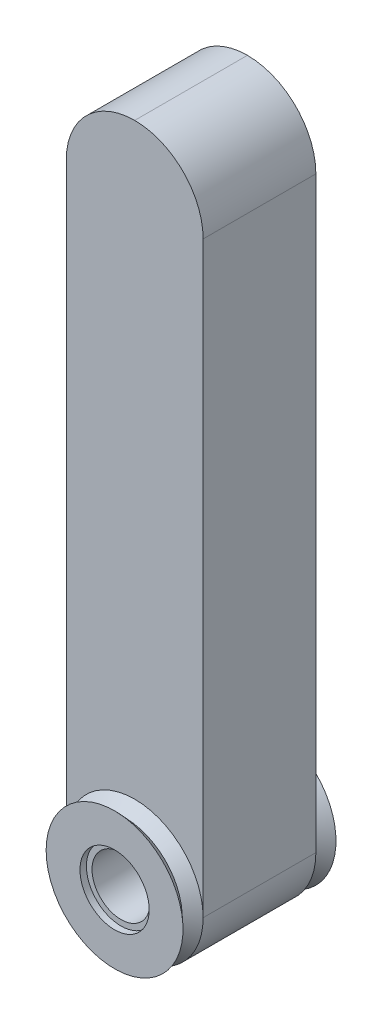
ISO-10303-21;
HEADER;
FILE_DESCRIPTION(('STEP AP214'),'2;1');
FILE_NAME('part.step','',(''),(''),'','','');
FILE_SCHEMA(('AUTOMOTIVE_DESIGN { 1 0 10303 214 1 1 1 1 }'));
ENDSEC;
DATA;
#1=APPLICATION_CONTEXT('core data for automotive mechanical design processes');
#2=APPLICATION_PROTOCOL_DEFINITION('international standard','automotive_design',2000,#1);
#3=PRODUCT_CONTEXT('',#1,'mechanical');
#4=PRODUCT('Part','Part','',(#3));
#5=PRODUCT_RELATED_PRODUCT_CATEGORY('part','',(#4));
#6=PRODUCT_DEFINITION_FORMATION('','',#4);
#7=PRODUCT_DEFINITION_CONTEXT('part definition',#1,'design');
#8=PRODUCT_DEFINITION('design','',#6,#7);
#9=PRODUCT_DEFINITION_SHAPE('','',#8);
#10=(LENGTH_UNIT() NAMED_UNIT(*) SI_UNIT(.MILLI.,.METRE.));
#11=(NAMED_UNIT(*) PLANE_ANGLE_UNIT() SI_UNIT($,.RADIAN.));
#12=(NAMED_UNIT(*) SI_UNIT($,.STERADIAN.) SOLID_ANGLE_UNIT());
#13=UNCERTAINTY_MEASURE_WITH_UNIT(LENGTH_MEASURE(1.E-05),#10,'distance_accuracy_value','');
#14=(GEOMETRIC_REPRESENTATION_CONTEXT(3) GLOBAL_UNCERTAINTY_ASSIGNED_CONTEXT((#13)) GLOBAL_UNIT_ASSIGNED_CONTEXT((#10,
#11,#12)) REPRESENTATION_CONTEXT('',''));
#15=CARTESIAN_POINT('',(0.,0.,0.));
#16=DIRECTION('',(0.,0.,1.));
#17=DIRECTION('',(1.,0.,0.));
#18=AXIS2_PLACEMENT_3D('',#15,#16,#17);
#19=CARTESIAN_POINT('',(0.,-36.5,7.));
#20=DIRECTION('',(0.,0.,-1.));
#21=DIRECTION('',(-1.,0.,0.));
#22=AXIS2_PLACEMENT_3D('',#19,#20,#21);
#23=CYLINDRICAL_SURFACE('',#22,3.6);
#24=CARTESIAN_POINT('',(0.,-36.5,8.7));
#25=DIRECTION('',(0.,0.,1.));
#26=DIRECTION('',(1.,0.,0.));
#27=AXIS2_PLACEMENT_3D('',#24,#25,#26);
#28=CIRCLE('',#27,3.6);
#29=CARTESIAN_POINT('',(3.6,-36.5,8.7));
#30=VERTEX_POINT('',#29);
#31=EDGE_CURVE('E144',#30,#30,#28,.T.);
#32=ORIENTED_EDGE('',*,*,#31,.T.);
#33=EDGE_LOOP('',(#32));
#34=FACE_BOUND('',#33,.T.);
#35=CARTESIAN_POINT('',(0.,-36.5,-8.7));
#36=DIRECTION('',(0.,0.,-1.));
#37=DIRECTION('',(-1.,0.,0.));
#38=AXIS2_PLACEMENT_3D('',#35,#36,#37);
#39=CIRCLE('',#38,3.6);
#40=CARTESIAN_POINT('',(-3.6,-36.5,-8.7));
#41=VERTEX_POINT('',#40);
#42=EDGE_CURVE('E36',#41,#41,#39,.T.);
#43=ORIENTED_EDGE('',*,*,#42,.T.);
#44=EDGE_LOOP('',(#43));
#45=FACE_BOUND('',#44,.T.);
#46=ADVANCED_FACE('F32',(#34,#45),#23,.F.);
#47=CARTESIAN_POINT('',(0.,-36.5,7.));
#48=DIRECTION('',(0.,0.,-1.));
#49=DIRECTION('',(-1.,0.,0.));
#50=AXIS2_PLACEMENT_3D('',#47,#48,#49);
#51=CYLINDRICAL_SURFACE('',#50,8.5);
#52=CARTESIAN_POINT('',(0.,-36.5,-7.));
#53=DIRECTION('',(0.,0.,-1.));
#54=DIRECTION('',(-1.,0.,0.));
#55=AXIS2_PLACEMENT_3D('',#52,#53,#54);
#56=CIRCLE('',#55,8.50000000000001);
#57=CARTESIAN_POINT('',(8.50000000000001,-36.5,-7.));
#58=VERTEX_POINT('',#57);
#59=CARTESIAN_POINT('',(0.,-45.,-7.));
#60=VERTEX_POINT('',#59);
#61=EDGE_CURVE('E91',#58,#60,#56,.T.);
#62=ORIENTED_EDGE('',*,*,#61,.F.);
#63=DIRECTION('',(0.,0.,-1.));
#64=VECTOR('',#63,1.);
#65=CARTESIAN_POINT('',(8.5,-36.5,7.));
#66=LINE('',#65,#64);
#67=CARTESIAN_POINT('',(8.5,-36.5,7.));
#68=VERTEX_POINT('',#67);
#69=EDGE_CURVE('E107',#68,#58,#66,.T.);
#70=ORIENTED_EDGE('',*,*,#69,.F.);
#71=CARTESIAN_POINT('',(0.,-36.5,7.));
#72=DIRECTION('',(0.,0.,-1.));
#73=DIRECTION('',(-1.,0.,0.));
#74=AXIS2_PLACEMENT_3D('',#71,#72,#73);
#75=CIRCLE('',#74,8.50000000000001);
#76=CARTESIAN_POINT('',(0.,-45.,7.));
#77=VERTEX_POINT('',#76);
#78=EDGE_CURVE('E151',#68,#77,#75,.T.);
#79=ORIENTED_EDGE('',*,*,#78,.T.);
#80=DIRECTION('',(0.,0.,-1.));
#81=VECTOR('',#80,1.);
#82=CARTESIAN_POINT('',(0.,-45.,7.));
#83=LINE('',#82,#81);
#84=EDGE_CURVE('E110',#77,#60,#83,.T.);
#85=ORIENTED_EDGE('',*,*,#84,.T.);
#86=EDGE_LOOP('',(#62,#70,#79,#85));
#87=FACE_BOUND('',#86,.T.);
#88=ADVANCED_FACE('F105',(#87),#51,.T.);
#89=CARTESIAN_POINT('',(0.,0.,7.));
#90=DIRECTION('',(0.,0.,1.));
#91=DIRECTION('',(1.,0.,0.));
#92=AXIS2_PLACEMENT_3D('',#89,#90,#91);
#93=PLANE('',#92);
#94=CARTESIAN_POINT('',(0.,-36.5,7.));
#95=DIRECTION('',(0.,0.,1.));
#96=DIRECTION('',(1.,0.,0.));
#97=AXIS2_PLACEMENT_3D('',#94,#95,#96);
#98=CIRCLE('',#97,8.5);
#99=CARTESIAN_POINT('',(-8.50000000000001,-36.5,7.));
#100=VERTEX_POINT('',#99);
#101=EDGE_CURVE('E143',#68,#100,#98,.T.);
#102=ORIENTED_EDGE('',*,*,#101,.F.);
#103=DIRECTION('',(0.,1.,0.));
#104=VECTOR('',#103,1.);
#105=CARTESIAN_POINT('',(8.5,-45.,7.));
#106=LINE('',#105,#104);
#107=CARTESIAN_POINT('',(8.5,36.5,7.));
#108=VERTEX_POINT('',#107);
#109=EDGE_CURVE('E118',#68,#108,#106,.T.);
#110=ORIENTED_EDGE('',*,*,#109,.T.);
#111=CARTESIAN_POINT('',(0.,36.5,7.));
#112=DIRECTION('',(0.,0.,1.));
#113=DIRECTION('',(1.,0.,0.));
#114=AXIS2_PLACEMENT_3D('',#111,#112,#113);
#115=CIRCLE('',#114,8.5);
#116=CARTESIAN_POINT('',(0.,45.,7.));
#117=VERTEX_POINT('',#116);
#118=EDGE_CURVE('E49',#108,#117,#115,.T.);
#119=ORIENTED_EDGE('',*,*,#118,.T.);
#120=CARTESIAN_POINT('',(0.,36.5,7.));
#121=DIRECTION('',(0.,0.,1.));
#122=DIRECTION('',(1.,0.,0.));
#123=AXIS2_PLACEMENT_3D('',#120,#121,#122);
#124=CIRCLE('',#123,8.5);
#125=CARTESIAN_POINT('',(-8.5,36.5,7.));
#126=VERTEX_POINT('',#125);
#127=EDGE_CURVE('E54',#117,#126,#124,.T.);
#128=ORIENTED_EDGE('',*,*,#127,.T.);
#129=DIRECTION('',(0.,-1.,0.));
#130=VECTOR('',#129,1.);
#131=CARTESIAN_POINT('',(-8.5,-45.,7.));
#132=LINE('',#131,#130);
#133=EDGE_CURVE('E125',#126,#100,#132,.T.);
#134=ORIENTED_EDGE('',*,*,#133,.T.);
#135=EDGE_LOOP('',(#102,#110,#119,#128,#134));
#136=FACE_BOUND('',#135,.T.);
#137=ADVANCED_FACE('F167',(#136),#93,.T.);
#138=CARTESIAN_POINT('',(0.,0.,-7.));
#139=DIRECTION('',(0.,0.,1.));
#140=DIRECTION('',(1.,0.,0.));
#141=AXIS2_PLACEMENT_3D('',#138,#139,#140);
#142=PLANE('',#141);
#143=DIRECTION('',(0.,1.,0.));
#144=VECTOR('',#143,1.);
#145=CARTESIAN_POINT('',(8.5,-45.,-7.));
#146=LINE('',#145,#144);
#147=CARTESIAN_POINT('',(8.5,36.5,-7.));
#148=VERTEX_POINT('',#147);
#149=EDGE_CURVE('E116',#58,#148,#146,.T.);
#150=ORIENTED_EDGE('',*,*,#149,.F.);
#151=CARTESIAN_POINT('',(0.,-36.5,-7.));
#152=DIRECTION('',(0.,0.,1.));
#153=DIRECTION('',(1.,0.,0.));
#154=AXIS2_PLACEMENT_3D('',#151,#152,#153);
#155=CIRCLE('',#154,8.5);
#156=CARTESIAN_POINT('',(-8.5,-36.5,-7.));
#157=VERTEX_POINT('',#156);
#158=EDGE_CURVE('E87',#58,#157,#155,.T.);
#159=ORIENTED_EDGE('',*,*,#158,.T.);
#160=DIRECTION('',(0.,-1.,0.));
#161=VECTOR('',#160,1.);
#162=CARTESIAN_POINT('',(-8.5,-45.,-7.));
#163=LINE('',#162,#161);
#164=CARTESIAN_POINT('',(-8.5,36.5,-7.));
#165=VERTEX_POINT('',#164);
#166=EDGE_CURVE('E126',#165,#157,#163,.T.);
#167=ORIENTED_EDGE('',*,*,#166,.F.);
#168=CARTESIAN_POINT('',(0.,36.5,-7.));
#169=DIRECTION('',(0.,0.,1.));
#170=DIRECTION('',(1.,0.,0.));
#171=AXIS2_PLACEMENT_3D('',#168,#169,#170);
#172=CIRCLE('',#171,8.5);
#173=CARTESIAN_POINT('',(0.,45.,-7.));
#174=VERTEX_POINT('',#173);
#175=EDGE_CURVE('E134',#165,#174,#172,.F.);
#176=ORIENTED_EDGE('',*,*,#175,.T.);
#177=CARTESIAN_POINT('',(0.,36.5,-7.));
#178=DIRECTION('',(0.,0.,1.));
#179=DIRECTION('',(1.,0.,0.));
#180=AXIS2_PLACEMENT_3D('',#177,#178,#179);
#181=CIRCLE('',#180,8.5);
#182=EDGE_CURVE('E120',#174,#148,#181,.F.);
#183=ORIENTED_EDGE('',*,*,#182,.T.);
#184=EDGE_LOOP('',(#150,#159,#167,#176,#183));
#185=FACE_BOUND('',#184,.T.);
#186=ADVANCED_FACE('F123',(#185),#142,.F.);
#187=CARTESIAN_POINT('',(-8.5,-45.,7.));
#188=DIRECTION('',(1.,0.,0.));
#189=DIRECTION('',(0.,0.,-1.));
#190=AXIS2_PLACEMENT_3D('',#187,#188,#189);
#191=PLANE('',#190);
#192=ORIENTED_EDGE('',*,*,#166,.T.);
#193=DIRECTION('',(0.,0.,-1.));
#194=VECTOR('',#193,1.);
#195=CARTESIAN_POINT('',(-8.5,-36.5,7.));
#196=LINE('',#195,#194);
#197=EDGE_CURVE('E11',#157,#100,#196,.F.);
#198=ORIENTED_EDGE('',*,*,#197,.T.);
#199=ORIENTED_EDGE('',*,*,#133,.F.);
#200=DIRECTION('',(0.,0.,-1.));
#201=VECTOR('',#200,1.);
#202=CARTESIAN_POINT('',(-8.5,36.5,7.));
#203=LINE('',#202,#201);
#204=EDGE_CURVE('E41',#126,#165,#203,.T.);
#205=ORIENTED_EDGE('',*,*,#204,.T.);
#206=EDGE_LOOP('',(#192,#198,#199,#205));
#207=FACE_BOUND('',#206,.T.);
#208=ADVANCED_FACE('F173',(#207),#191,.F.);
#209=CARTESIAN_POINT('',(8.5,-45.,7.));
#210=DIRECTION('',(-1.,0.,0.));
#211=DIRECTION('',(0.,0.,1.));
#212=AXIS2_PLACEMENT_3D('',#209,#210,#211);
#213=PLANE('',#212);
#214=ORIENTED_EDGE('',*,*,#109,.F.);
#215=ORIENTED_EDGE('',*,*,#69,.T.);
#216=ORIENTED_EDGE('',*,*,#149,.T.);
#217=DIRECTION('',(0.,0.,-1.));
#218=VECTOR('',#217,1.);
#219=CARTESIAN_POINT('',(8.5,36.5,7.));
#220=LINE('',#219,#218);
#221=EDGE_CURVE('E121',#148,#108,#220,.F.);
#222=ORIENTED_EDGE('',*,*,#221,.T.);
#223=EDGE_LOOP('',(#214,#215,#216,#222));
#224=FACE_BOUND('',#223,.T.);
#225=ADVANCED_FACE('F115',(#224),#213,.F.);
#226=EDGE_CURVE('E93',#60,#157,#56,.T.);
#227=ORIENTED_EDGE('',*,*,#226,.F.);
#228=ORIENTED_EDGE('',*,*,#84,.F.);
#229=EDGE_CURVE('E146',#77,#100,#75,.T.);
#230=ORIENTED_EDGE('',*,*,#229,.T.);
#231=ORIENTED_EDGE('',*,*,#197,.F.);
#232=EDGE_LOOP('',(#227,#228,#230,#231));
#233=FACE_BOUND('',#232,.T.);
#234=ADVANCED_FACE('F176',(#233),#51,.T.);
#235=CARTESIAN_POINT('',(0.,36.5,7.));
#236=DIRECTION('',(0.,0.,-1.));
#237=DIRECTION('',(-1.,0.,0.));
#238=AXIS2_PLACEMENT_3D('',#235,#236,#237);
#239=CYLINDRICAL_SURFACE('',#238,8.5);
#240=DIRECTION('',(0.,0.,-1.));
#241=VECTOR('',#240,1.);
#242=CARTESIAN_POINT('',(0.,45.,7.));
#243=LINE('',#242,#241);
#244=EDGE_CURVE('E141',#117,#174,#243,.T.);
#245=ORIENTED_EDGE('',*,*,#244,.F.);
#246=ORIENTED_EDGE('',*,*,#118,.F.);
#247=ORIENTED_EDGE('',*,*,#221,.F.);
#248=ORIENTED_EDGE('',*,*,#182,.F.);
#249=EDGE_LOOP('',(#245,#246,#247,#248));
#250=FACE_BOUND('',#249,.T.);
#251=ADVANCED_FACE('F34',(#250),#239,.T.);
#252=CARTESIAN_POINT('',(0.,36.5,7.));
#253=DIRECTION('',(0.,0.,-1.));
#254=DIRECTION('',(-1.,0.,0.));
#255=AXIS2_PLACEMENT_3D('',#252,#253,#254);
#256=CYLINDRICAL_SURFACE('',#255,8.5);
#257=ORIENTED_EDGE('',*,*,#127,.F.);
#258=ORIENTED_EDGE('',*,*,#244,.T.);
#259=ORIENTED_EDGE('',*,*,#175,.F.);
#260=ORIENTED_EDGE('',*,*,#204,.F.);
#261=EDGE_LOOP('',(#257,#258,#259,#260));
#262=FACE_BOUND('',#261,.T.);
#263=ADVANCED_FACE('F171',(#262),#256,.T.);
#264=CARTESIAN_POINT('',(0.,-36.5,9.5));
#265=DIRECTION('',(0.,0.,1.));
#266=DIRECTION('',(1.,0.,0.));
#267=AXIS2_PLACEMENT_3D('',#264,#265,#266);
#268=PLANE('',#267);
#269=CARTESIAN_POINT('',(0.,-36.5,9.5));
#270=DIRECTION('',(0.,0.,1.));
#271=DIRECTION('',(1.,0.,0.));
#272=AXIS2_PLACEMENT_3D('',#269,#270,#271);
#273=CIRCLE('',#272,4.3);
#274=CARTESIAN_POINT('',(4.3,-36.5,9.5));
#275=VERTEX_POINT('',#274);
#276=EDGE_CURVE('E98',#275,#275,#273,.T.);
#277=ORIENTED_EDGE('',*,*,#276,.F.);
#278=EDGE_LOOP('',(#277));
#279=FACE_BOUND('',#278,.T.);
#280=CARTESIAN_POINT('',(0.,-36.5,9.5));
#281=DIRECTION('',(0.,0.,-1.));
#282=DIRECTION('',(-1.,0.,0.));
#283=AXIS2_PLACEMENT_3D('',#280,#281,#282);
#284=CIRCLE('',#283,8.50000000000001);
#285=CARTESIAN_POINT('',(-8.50000000000001,-36.5,9.5));
#286=VERTEX_POINT('',#285);
#287=EDGE_CURVE('E164',#286,#286,#284,.T.);
#288=ORIENTED_EDGE('',*,*,#287,.F.);
#289=EDGE_LOOP('',(#288));
#290=FACE_BOUND('',#289,.T.);
#291=ADVANCED_FACE('F188',(#279,#290),#268,.T.);
#292=CARTESIAN_POINT('',(0.,-36.5,9.5));
#293=DIRECTION('',(0.,0.,1.));
#294=DIRECTION('',(1.,0.,0.));
#295=AXIS2_PLACEMENT_3D('',#292,#293,#294);
#296=CONICAL_SURFACE('',#295,8.50000000000001,0.823840753418637);
#297=CARTESIAN_POINT('',(0.,-36.5,8.25));
#298=DIRECTION('',(0.,0.,-1.));
#299=DIRECTION('',(-1.,0.,0.));
#300=AXIS2_PLACEMENT_3D('',#297,#298,#299);
#301=CIRCLE('',#300,7.15000000000001);
#302=CARTESIAN_POINT('',(-7.15000000000001,-36.5,8.25));
#303=VERTEX_POINT('',#302);
#304=EDGE_CURVE('E161',#303,#303,#301,.T.);
#305=ORIENTED_EDGE('',*,*,#304,.F.);
#306=EDGE_LOOP('',(#305));
#307=FACE_BOUND('',#306,.T.);
#308=ORIENTED_EDGE('',*,*,#287,.T.);
#309=EDGE_LOOP('',(#308));
#310=FACE_BOUND('',#309,.T.);
#311=ADVANCED_FACE('F182',(#307,#310),#296,.T.);
#312=CARTESIAN_POINT('',(0.,-36.5,8.25));
#313=DIRECTION('',(0.,0.,-1.));
#314=DIRECTION('',(-1.,0.,0.));
#315=AXIS2_PLACEMENT_3D('',#312,#313,#314);
#316=CONICAL_SURFACE('',#315,7.15000000000001,0.823840753418636);
#317=ORIENTED_EDGE('',*,*,#101,.T.);
#318=ORIENTED_EDGE('',*,*,#229,.F.);
#319=ORIENTED_EDGE('',*,*,#78,.F.);
#320=EDGE_LOOP('',(#317,#318,#319));
#321=FACE_BOUND('',#320,.T.);
#322=ORIENTED_EDGE('',*,*,#304,.T.);
#323=EDGE_LOOP('',(#322));
#324=FACE_BOUND('',#323,.T.);
#325=ADVANCED_FACE('F178',(#321,#324),#316,.T.);
#326=CARTESIAN_POINT('',(0.,-36.5,8.7));
#327=DIRECTION('',(0.,0.,1.));
#328=DIRECTION('',(1.,0.,0.));
#329=AXIS2_PLACEMENT_3D('',#326,#327,#328);
#330=CYLINDRICAL_SURFACE('',#329,4.3);
#331=CARTESIAN_POINT('',(0.,-36.5,8.7));
#332=DIRECTION('',(0.,0.,1.));
#333=DIRECTION('',(1.,0.,0.));
#334=AXIS2_PLACEMENT_3D('',#331,#332,#333);
#335=CIRCLE('',#334,4.3);
#336=CARTESIAN_POINT('',(4.3,-36.5,8.7));
#337=VERTEX_POINT('',#336);
#338=EDGE_CURVE('E147',#337,#337,#335,.T.);
#339=ORIENTED_EDGE('',*,*,#338,.F.);
#340=EDGE_LOOP('',(#339));
#341=FACE_BOUND('',#340,.T.);
#342=ORIENTED_EDGE('',*,*,#276,.T.);
#343=EDGE_LOOP('',(#342));
#344=FACE_BOUND('',#343,.T.);
#345=ADVANCED_FACE('F181',(#341,#344),#330,.F.);
#346=CARTESIAN_POINT('',(0.,-36.5,8.7));
#347=DIRECTION('',(0.,0.,1.));
#348=DIRECTION('',(1.,0.,0.));
#349=AXIS2_PLACEMENT_3D('',#346,#347,#348);
#350=PLANE('',#349);
#351=ORIENTED_EDGE('',*,*,#31,.F.);
#352=EDGE_LOOP('',(#351));
#353=FACE_BOUND('',#352,.T.);
#354=ORIENTED_EDGE('',*,*,#338,.T.);
#355=EDGE_LOOP('',(#354));
#356=FACE_BOUND('',#355,.T.);
#357=ADVANCED_FACE('F258',(#353,#356),#350,.T.);
#358=CARTESIAN_POINT('',(0.,-36.5,-9.5));
#359=DIRECTION('',(0.,0.,-1.));
#360=DIRECTION('',(1.,0.,0.));
#361=AXIS2_PLACEMENT_3D('',#358,#359,#360);
#362=PLANE('',#361);
#363=CARTESIAN_POINT('',(0.,-36.5,-9.5));
#364=DIRECTION('',(0.,0.,1.));
#365=DIRECTION('',(1.,0.,0.));
#366=AXIS2_PLACEMENT_3D('',#363,#364,#365);
#367=CIRCLE('',#366,4.3);
#368=CARTESIAN_POINT('',(4.3,-36.5,-9.5));
#369=VERTEX_POINT('',#368);
#370=EDGE_CURVE('E362',#369,#369,#367,.T.);
#371=ORIENTED_EDGE('',*,*,#370,.T.);
#372=EDGE_LOOP('',(#371));
#373=FACE_BOUND('',#372,.T.);
#374=CARTESIAN_POINT('',(0.,-36.5,-9.5));
#375=DIRECTION('',(0.,0.,-1.));
#376=DIRECTION('',(-1.,0.,0.));
#377=AXIS2_PLACEMENT_3D('',#374,#375,#376);
#378=CIRCLE('',#377,8.50000000000001);
#379=CARTESIAN_POINT('',(-8.50000000000001,-36.5,-9.5));
#380=VERTEX_POINT('',#379);
#381=EDGE_CURVE('E99',#380,#380,#378,.T.);
#382=ORIENTED_EDGE('',*,*,#381,.T.);
#383=EDGE_LOOP('',(#382));
#384=FACE_BOUND('',#383,.T.);
#385=ADVANCED_FACE('F267',(#373,#384),#362,.T.);
#386=CARTESIAN_POINT('',(0.,-36.5,-9.5));
#387=DIRECTION('',(0.,0.,-1.));
#388=DIRECTION('',(1.,0.,0.));
#389=AXIS2_PLACEMENT_3D('',#386,#387,#388);
#390=CONICAL_SURFACE('',#389,8.50000000000001,0.823840753418637);
#391=CARTESIAN_POINT('',(0.,-36.5,-8.25));
#392=DIRECTION('',(0.,0.,-1.));
#393=DIRECTION('',(-1.,0.,0.));
#394=AXIS2_PLACEMENT_3D('',#391,#392,#393);
#395=CIRCLE('',#394,7.15000000000001);
#396=CARTESIAN_POINT('',(-7.15000000000001,-36.5,-8.25));
#397=VERTEX_POINT('',#396);
#398=EDGE_CURVE('E111',#397,#397,#395,.T.);
#399=ORIENTED_EDGE('',*,*,#398,.T.);
#400=EDGE_LOOP('',(#399));
#401=FACE_BOUND('',#400,.T.);
#402=ORIENTED_EDGE('',*,*,#381,.F.);
#403=EDGE_LOOP('',(#402));
#404=FACE_BOUND('',#403,.T.);
#405=ADVANCED_FACE('F314',(#401,#404),#390,.T.);
#406=CARTESIAN_POINT('',(0.,-36.5,-8.25));
#407=DIRECTION('',(0.,0.,1.));
#408=DIRECTION('',(-1.,0.,0.));
#409=AXIS2_PLACEMENT_3D('',#406,#407,#408);
#410=CONICAL_SURFACE('',#409,7.15000000000001,0.823840753418636);
#411=ORIENTED_EDGE('',*,*,#158,.F.);
#412=ORIENTED_EDGE('',*,*,#61,.T.);
#413=ORIENTED_EDGE('',*,*,#226,.T.);
#414=EDGE_LOOP('',(#411,#412,#413));
#415=FACE_BOUND('',#414,.T.);
#416=ORIENTED_EDGE('',*,*,#398,.F.);
#417=EDGE_LOOP('',(#416));
#418=FACE_BOUND('',#417,.T.);
#419=ADVANCED_FACE('F89',(#415,#418),#410,.T.);
#420=CARTESIAN_POINT('',(0.,-36.5,-8.7));
#421=DIRECTION('',(0.,0.,-1.));
#422=DIRECTION('',(-1.,0.,0.));
#423=AXIS2_PLACEMENT_3D('',#420,#421,#422);
#424=CYLINDRICAL_SURFACE('',#423,4.3);
#425=CARTESIAN_POINT('',(0.,-36.5,-8.7));
#426=DIRECTION('',(0.,0.,1.));
#427=DIRECTION('',(1.,0.,0.));
#428=AXIS2_PLACEMENT_3D('',#425,#426,#427);
#429=CIRCLE('',#428,4.3);
#430=CARTESIAN_POINT('',(4.3,-36.5,-8.7));
#431=VERTEX_POINT('',#430);
#432=EDGE_CURVE('E361',#431,#431,#429,.T.);
#433=ORIENTED_EDGE('',*,*,#432,.T.);
#434=EDGE_LOOP('',(#433));
#435=FACE_BOUND('',#434,.T.);
#436=ORIENTED_EDGE('',*,*,#370,.F.);
#437=EDGE_LOOP('',(#436));
#438=FACE_BOUND('',#437,.T.);
#439=ADVANCED_FACE('F333',(#435,#438),#424,.F.);
#440=CARTESIAN_POINT('',(0.,-36.5,-8.7));
#441=DIRECTION('',(0.,0.,-1.));
#442=DIRECTION('',(1.,0.,0.));
#443=AXIS2_PLACEMENT_3D('',#440,#441,#442);
#444=PLANE('',#443);
#445=ORIENTED_EDGE('',*,*,#42,.F.);
#446=EDGE_LOOP('',(#445));
#447=FACE_BOUND('',#446,.T.);
#448=ORIENTED_EDGE('',*,*,#432,.F.);
#449=EDGE_LOOP('',(#448));
#450=FACE_BOUND('',#449,.T.);
#451=ADVANCED_FACE('F342',(#447,#450),#444,.T.);
#452=CLOSED_SHELL('',(#46,#88,#137,#186,#208,#225,#234,#251,#263,#291,#311,#325,#345,#357,#385,
#405,#419,#439,#451));
#453=MANIFOLD_SOLID_BREP('B2',#452);
#454=ADVANCED_BREP_SHAPE_REPRESENTATION('',(#18,#453),#14);
#455=SHAPE_DEFINITION_REPRESENTATION(#9,#454);
ENDSEC;
END-ISO-10303-21;
